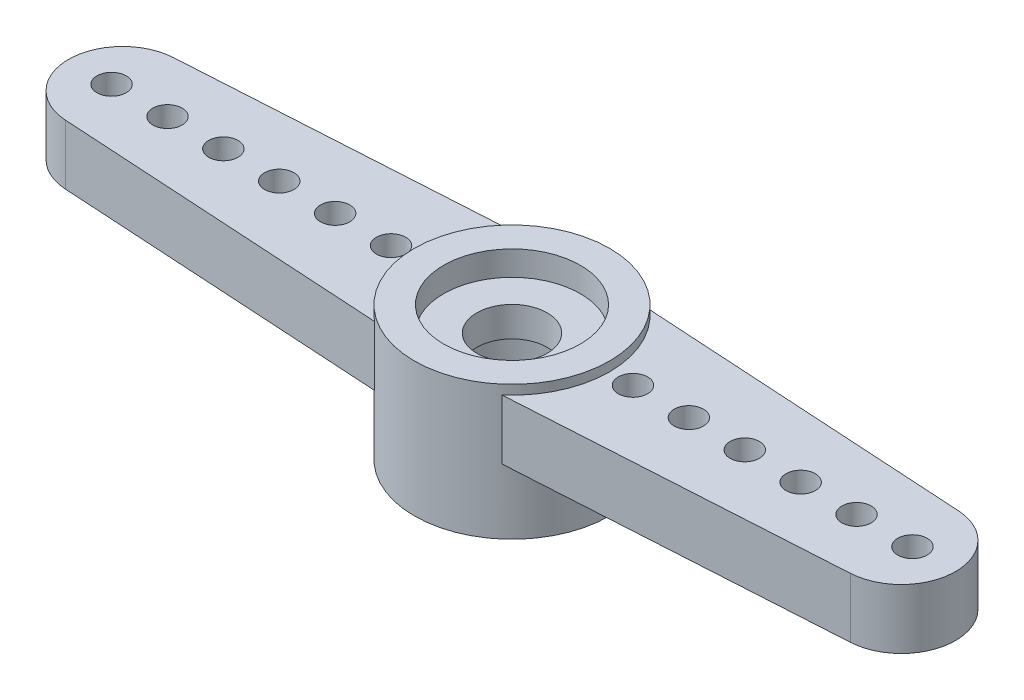
ISO-10303-21;
HEADER;
FILE_DESCRIPTION(('STEP AP214'),'2;1');
FILE_NAME('part.step','',(''),(''),'','','');
FILE_SCHEMA(('AUTOMOTIVE_DESIGN { 1 0 10303 214 1 1 1 1 }'));
ENDSEC;
DATA;
#1=APPLICATION_CONTEXT('core data for automotive mechanical design processes');
#2=APPLICATION_PROTOCOL_DEFINITION('international standard','automotive_design',2000,#1);
#3=PRODUCT_CONTEXT('',#1,'mechanical');
#4=PRODUCT('Part','Part','',(#3));
#5=PRODUCT_RELATED_PRODUCT_CATEGORY('part','',(#4));
#6=PRODUCT_DEFINITION_FORMATION('','',#4);
#7=PRODUCT_DEFINITION_CONTEXT('part definition',#1,'design');
#8=PRODUCT_DEFINITION('design','',#6,#7);
#9=PRODUCT_DEFINITION_SHAPE('','',#8);
#10=(LENGTH_UNIT() NAMED_UNIT(*) SI_UNIT(.MILLI.,.METRE.));
#11=(NAMED_UNIT(*) PLANE_ANGLE_UNIT() SI_UNIT($,.RADIAN.));
#12=(NAMED_UNIT(*) SI_UNIT($,.STERADIAN.) SOLID_ANGLE_UNIT());
#13=UNCERTAINTY_MEASURE_WITH_UNIT(LENGTH_MEASURE(1.E-05),#10,'distance_accuracy_value','');
#14=(GEOMETRIC_REPRESENTATION_CONTEXT(3) GLOBAL_UNCERTAINTY_ASSIGNED_CONTEXT((#13)) GLOBAL_UNIT_ASSIGNED_CONTEXT((#10,
#11,#12)) REPRESENTATION_CONTEXT('',''));
#15=CARTESIAN_POINT('',(0.,0.,0.));
#16=DIRECTION('',(0.,0.,1.));
#17=DIRECTION('',(1.,0.,0.));
#18=AXIS2_PLACEMENT_3D('',#15,#16,#17);
#19=CARTESIAN_POINT('',(0.,4.715,0.));
#20=DIRECTION('',(0.,-1.,0.));
#21=DIRECTION('',(0.,0.,-1.));
#22=AXIS2_PLACEMENT_3D('',#19,#20,#21);
#23=CYLINDRICAL_SURFACE('',#22,1.235);
#24=CARTESIAN_POINT('',(0.,2.8,0.));
#25=DIRECTION('',(0.,-1.,0.));
#26=DIRECTION('',(0.,0.,-1.));
#27=AXIS2_PLACEMENT_3D('',#24,#25,#26);
#28=CIRCLE('',#27,1.235);
#29=CARTESIAN_POINT('',(0.,2.8,-1.235));
#30=VERTEX_POINT('',#29);
#31=EDGE_CURVE('E219',#30,#30,#28,.F.);
#32=ORIENTED_EDGE('',*,*,#31,.F.);
#33=EDGE_LOOP('',(#32));
#34=FACE_BOUND('',#33,.T.);
#35=CARTESIAN_POINT('',(0.,3.85,0.));
#36=DIRECTION('',(0.,-1.,0.));
#37=DIRECTION('',(0.,0.,-1.));
#38=AXIS2_PLACEMENT_3D('',#35,#36,#37);
#39=CIRCLE('',#38,1.235);
#40=CARTESIAN_POINT('',(0.,3.85,-1.235));
#41=VERTEX_POINT('',#40);
#42=EDGE_CURVE('E19',#41,#41,#39,.T.);
#43=ORIENTED_EDGE('',*,*,#42,.F.);
#44=EDGE_LOOP('',(#43));
#45=FACE_BOUND('',#44,.T.);
#46=ADVANCED_FACE('F16',(#34,#45),#23,.F.);
#47=CARTESIAN_POINT('',(0.,3.85,0.));
#48=DIRECTION('',(0.,1.,0.));
#49=DIRECTION('',(0.,0.,1.));
#50=AXIS2_PLACEMENT_3D('',#47,#48,#49);
#51=PLANE('',#50);
#52=CARTESIAN_POINT('',(0.,3.85,0.));
#53=DIRECTION('',(0.,1.,0.));
#54=DIRECTION('',(0.,0.,1.));
#55=AXIS2_PLACEMENT_3D('',#52,#53,#54);
#56=CIRCLE('',#55,2.4);
#57=CARTESIAN_POINT('',(0.,3.85,2.4));
#58=VERTEX_POINT('',#57);
#59=EDGE_CURVE('E217',#58,#58,#56,.T.);
#60=ORIENTED_EDGE('',*,*,#59,.T.);
#61=EDGE_LOOP('',(#60));
#62=FACE_BOUND('',#61,.T.);
#63=ORIENTED_EDGE('',*,*,#42,.T.);
#64=EDGE_LOOP('',(#63));
#65=FACE_BOUND('',#64,.T.);
#66=ADVANCED_FACE('F226',(#62,#65),#51,.T.);
#67=CARTESIAN_POINT('',(14.07,2.285,0.));
#68=DIRECTION('',(0.,1.,0.));
#69=DIRECTION('',(0.,0.,1.));
#70=AXIS2_PLACEMENT_3D('',#67,#68,#69);
#71=CYLINDRICAL_SURFACE('',#70,0.514999999999999);
#72=CARTESIAN_POINT('',(14.07,2.285,0.));
#73=DIRECTION('',(0.,1.,0.));
#74=DIRECTION('',(0.,0.,1.));
#75=AXIS2_PLACEMENT_3D('',#72,#73,#74);
#76=CIRCLE('',#75,0.514999999999999);
#77=CARTESIAN_POINT('',(14.07,2.285,0.515000000000068));
#78=VERTEX_POINT('',#77);
#79=EDGE_CURVE('E214',#78,#78,#76,.F.);
#80=ORIENTED_EDGE('',*,*,#79,.T.);
#81=EDGE_LOOP('',(#80));
#82=FACE_BOUND('',#81,.T.);
#83=CARTESIAN_POINT('',(14.07,4.385,0.));
#84=DIRECTION('',(0.,1.,0.));
#85=DIRECTION('',(0.,0.,1.));
#86=AXIS2_PLACEMENT_3D('',#83,#84,#85);
#87=CIRCLE('',#86,0.514999999999999);
#88=CARTESIAN_POINT('',(14.07,4.385,0.515000000000068));
#89=VERTEX_POINT('',#88);
#90=EDGE_CURVE('E100',#89,#89,#87,.F.);
#91=ORIENTED_EDGE('',*,*,#90,.F.);
#92=EDGE_LOOP('',(#91));
#93=FACE_BOUND('',#92,.T.);
#94=ADVANCED_FACE('F234',(#82,#93),#71,.F.);
#95=CARTESIAN_POINT('',(12.106,2.285,0.));
#96=DIRECTION('',(0.,1.,0.));
#97=DIRECTION('',(0.,0.,1.));
#98=AXIS2_PLACEMENT_3D('',#95,#96,#97);
#99=CYLINDRICAL_SURFACE('',#98,0.515000000000001);
#100=CARTESIAN_POINT('',(12.106,2.285,0.));
#101=DIRECTION('',(0.,1.,0.));
#102=DIRECTION('',(0.,0.,1.));
#103=AXIS2_PLACEMENT_3D('',#100,#101,#102);
#104=CIRCLE('',#103,0.515000000000001);
#105=CARTESIAN_POINT('',(12.106,2.285,0.515000000000056));
#106=VERTEX_POINT('',#105);
#107=EDGE_CURVE('E211',#106,#106,#104,.F.);
#108=ORIENTED_EDGE('',*,*,#107,.T.);
#109=EDGE_LOOP('',(#108));
#110=FACE_BOUND('',#109,.T.);
#111=CARTESIAN_POINT('',(12.106,4.385,0.));
#112=DIRECTION('',(0.,1.,0.));
#113=DIRECTION('',(0.,0.,1.));
#114=AXIS2_PLACEMENT_3D('',#111,#112,#113);
#115=CIRCLE('',#114,0.515000000000001);
#116=CARTESIAN_POINT('',(12.106,4.385,0.515000000000056));
#117=VERTEX_POINT('',#116);
#118=EDGE_CURVE('E198',#117,#117,#115,.F.);
#119=ORIENTED_EDGE('',*,*,#118,.F.);
#120=EDGE_LOOP('',(#119));
#121=FACE_BOUND('',#120,.T.);
#122=ADVANCED_FACE('F337',(#110,#121),#99,.F.);
#123=CARTESIAN_POINT('',(10.142,2.285,0.));
#124=DIRECTION('',(0.,1.,0.));
#125=DIRECTION('',(0.,0.,1.));
#126=AXIS2_PLACEMENT_3D('',#123,#124,#125);
#127=CYLINDRICAL_SURFACE('',#126,0.514999999999999);
#128=CARTESIAN_POINT('',(10.142,2.285,0.));
#129=DIRECTION('',(0.,1.,0.));
#130=DIRECTION('',(0.,0.,1.));
#131=AXIS2_PLACEMENT_3D('',#128,#129,#130);
#132=CIRCLE('',#131,0.514999999999999);
#133=CARTESIAN_POINT('',(10.142,2.285,0.51500000000004));
#134=VERTEX_POINT('',#133);
#135=EDGE_CURVE('E208',#134,#134,#132,.F.);
#136=ORIENTED_EDGE('',*,*,#135,.T.);
#137=EDGE_LOOP('',(#136));
#138=FACE_BOUND('',#137,.T.);
#139=CARTESIAN_POINT('',(10.142,4.385,0.));
#140=DIRECTION('',(0.,1.,0.));
#141=DIRECTION('',(0.,0.,1.));
#142=AXIS2_PLACEMENT_3D('',#139,#140,#141);
#143=CIRCLE('',#142,0.514999999999999);
#144=CARTESIAN_POINT('',(10.142,4.385,0.51500000000004));
#145=VERTEX_POINT('',#144);
#146=EDGE_CURVE('E195',#145,#145,#143,.F.);
#147=ORIENTED_EDGE('',*,*,#146,.F.);
#148=EDGE_LOOP('',(#147));
#149=FACE_BOUND('',#148,.T.);
#150=ADVANCED_FACE('F333',(#138,#149),#127,.F.);
#151=CARTESIAN_POINT('',(8.178,2.285,0.));
#152=DIRECTION('',(0.,1.,0.));
#153=DIRECTION('',(0.,0.,1.));
#154=AXIS2_PLACEMENT_3D('',#151,#152,#153);
#155=CYLINDRICAL_SURFACE('',#154,0.515);
#156=CARTESIAN_POINT('',(8.178,2.285,0.));
#157=DIRECTION('',(0.,1.,0.));
#158=DIRECTION('',(0.,0.,1.));
#159=AXIS2_PLACEMENT_3D('',#156,#157,#158);
#160=CIRCLE('',#159,0.515);
#161=CARTESIAN_POINT('',(8.178,2.285,0.515000000000027));
#162=VERTEX_POINT('',#161);
#163=EDGE_CURVE('E205',#162,#162,#160,.F.);
#164=ORIENTED_EDGE('',*,*,#163,.T.);
#165=EDGE_LOOP('',(#164));
#166=FACE_BOUND('',#165,.T.);
#167=CARTESIAN_POINT('',(8.178,4.385,0.));
#168=DIRECTION('',(0.,1.,0.));
#169=DIRECTION('',(0.,0.,1.));
#170=AXIS2_PLACEMENT_3D('',#167,#168,#169);
#171=CIRCLE('',#170,0.515);
#172=CARTESIAN_POINT('',(8.178,4.385,0.515000000000027));
#173=VERTEX_POINT('',#172);
#174=EDGE_CURVE('E192',#173,#173,#171,.F.);
#175=ORIENTED_EDGE('',*,*,#174,.F.);
#176=EDGE_LOOP('',(#175));
#177=FACE_BOUND('',#176,.T.);
#178=ADVANCED_FACE('F329',(#166,#177),#155,.F.);
#179=CARTESIAN_POINT('',(6.214,2.285,0.));
#180=DIRECTION('',(0.,1.,0.));
#181=DIRECTION('',(0.,0.,1.));
#182=AXIS2_PLACEMENT_3D('',#179,#180,#181);
#183=CYLINDRICAL_SURFACE('',#182,0.515);
#184=CARTESIAN_POINT('',(6.214,2.285,0.));
#185=DIRECTION('',(0.,1.,0.));
#186=DIRECTION('',(0.,0.,1.));
#187=AXIS2_PLACEMENT_3D('',#184,#185,#186);
#188=CIRCLE('',#187,0.515);
#189=CARTESIAN_POINT('',(6.214,2.285,0.515000000000014));
#190=VERTEX_POINT('',#189);
#191=EDGE_CURVE('E91',#190,#190,#188,.F.);
#192=ORIENTED_EDGE('',*,*,#191,.T.);
#193=EDGE_LOOP('',(#192));
#194=FACE_BOUND('',#193,.T.);
#195=CARTESIAN_POINT('',(6.214,4.385,0.));
#196=DIRECTION('',(0.,1.,0.));
#197=DIRECTION('',(0.,0.,1.));
#198=AXIS2_PLACEMENT_3D('',#195,#196,#197);
#199=CIRCLE('',#198,0.515);
#200=CARTESIAN_POINT('',(6.214,4.385,0.515000000000014));
#201=VERTEX_POINT('',#200);
#202=EDGE_CURVE('E189',#201,#201,#199,.F.);
#203=ORIENTED_EDGE('',*,*,#202,.F.);
#204=EDGE_LOOP('',(#203));
#205=FACE_BOUND('',#204,.T.);
#206=ADVANCED_FACE('F325',(#194,#205),#183,.F.);
#207=CARTESIAN_POINT('',(4.25,2.285,0.));
#208=DIRECTION('',(0.,1.,0.));
#209=DIRECTION('',(0.,0.,1.));
#210=AXIS2_PLACEMENT_3D('',#207,#208,#209);
#211=CYLINDRICAL_SURFACE('',#210,0.515);
#212=CARTESIAN_POINT('',(4.25,2.285,0.));
#213=DIRECTION('',(0.,1.,0.));
#214=DIRECTION('',(0.,0.,1.));
#215=AXIS2_PLACEMENT_3D('',#212,#213,#214);
#216=CIRCLE('',#215,0.515);
#217=CARTESIAN_POINT('',(4.25,2.285,0.515000000000001));
#218=VERTEX_POINT('',#217);
#219=EDGE_CURVE('E90',#218,#218,#216,.F.);
#220=ORIENTED_EDGE('',*,*,#219,.T.);
#221=EDGE_LOOP('',(#220));
#222=FACE_BOUND('',#221,.T.);
#223=CARTESIAN_POINT('',(4.25,4.385,0.));
#224=DIRECTION('',(0.,1.,0.));
#225=DIRECTION('',(0.,0.,1.));
#226=AXIS2_PLACEMENT_3D('',#223,#224,#225);
#227=CIRCLE('',#226,0.515);
#228=CARTESIAN_POINT('',(4.25,4.385,0.515000000000001));
#229=VERTEX_POINT('',#228);
#230=EDGE_CURVE('E115',#229,#229,#227,.F.);
#231=ORIENTED_EDGE('',*,*,#230,.F.);
#232=EDGE_LOOP('',(#231));
#233=FACE_BOUND('',#232,.T.);
#234=ADVANCED_FACE('F322',(#222,#233),#211,.F.);
#235=CARTESIAN_POINT('',(13.6815650653264,2.285,0.));
#236=DIRECTION('',(0.,1.,0.));
#237=DIRECTION('',(0.,0.,1.));
#238=AXIS2_PLACEMENT_3D('',#235,#236,#237);
#239=CYLINDRICAL_SURFACE('',#238,1.90343493467358);
#240=CARTESIAN_POINT('',(13.6815650653264,2.285,0.));
#241=DIRECTION('',(0.,1.,0.));
#242=DIRECTION('',(0.,0.,1.));
#243=AXIS2_PLACEMENT_3D('',#240,#241,#242);
#244=CIRCLE('',#243,1.90343493467358);
#245=CARTESIAN_POINT('',(13.7958653301373,2.285,1.9));
#246=VERTEX_POINT('',#245);
#247=CARTESIAN_POINT('',(13.7958653301373,2.285,-1.9));
#248=VERTEX_POINT('',#247);
#249=EDGE_CURVE('E79',#246,#248,#244,.T.);
#250=ORIENTED_EDGE('',*,*,#249,.T.);
#251=DIRECTION('',(0.,1.,0.));
#252=VECTOR('',#251,1.);
#253=CARTESIAN_POINT('',(13.7958653301373,2.285,-1.9));
#254=LINE('',#253,#252);
#255=CARTESIAN_POINT('',(13.7958653301373,4.385,-1.9));
#256=VERTEX_POINT('',#255);
#257=EDGE_CURVE('E114',#248,#256,#254,.T.);
#258=ORIENTED_EDGE('',*,*,#257,.T.);
#259=CARTESIAN_POINT('',(13.6815650653264,4.385,0.));
#260=DIRECTION('',(0.,1.,0.));
#261=DIRECTION('',(0.,0.,1.));
#262=AXIS2_PLACEMENT_3D('',#259,#260,#261);
#263=CIRCLE('',#262,1.90343493467358);
#264=CARTESIAN_POINT('',(13.7958653301373,4.385,1.9));
#265=VERTEX_POINT('',#264);
#266=EDGE_CURVE('E97',#265,#256,#263,.T.);
#267=ORIENTED_EDGE('',*,*,#266,.F.);
#268=DIRECTION('',(0.,1.,0.));
#269=VECTOR('',#268,1.);
#270=CARTESIAN_POINT('',(13.7958653301373,2.285,1.9));
#271=LINE('',#270,#269);
#272=EDGE_CURVE('E94',#246,#265,#271,.T.);
#273=ORIENTED_EDGE('',*,*,#272,.F.);
#274=EDGE_LOOP('',(#250,#258,#267,#273));
#275=FACE_BOUND('',#274,.T.);
#276=ADVANCED_FACE('F95',(#275),#239,.T.);
#277=CARTESIAN_POINT('',(0.,2.8,0.));
#278=DIRECTION('',(0.,-1.,0.));
#279=DIRECTION('',(0.,0.,-1.));
#280=AXIS2_PLACEMENT_3D('',#277,#278,#279);
#281=PLANE('',#280);
#282=CARTESIAN_POINT('',(0.,2.8,0.));
#283=DIRECTION('',(0.,-1.,0.));
#284=DIRECTION('',(0.,0.,-1.));
#285=AXIS2_PLACEMENT_3D('',#282,#283,#284);
#286=CIRCLE('',#285,2.345);
#287=CARTESIAN_POINT('',(0.,2.8,-2.345));
#288=VERTEX_POINT('',#287);
#289=EDGE_CURVE('E182',#288,#288,#286,.T.);
#290=ORIENTED_EDGE('',*,*,#289,.T.);
#291=EDGE_LOOP('',(#290));
#292=FACE_BOUND('',#291,.T.);
#293=ORIENTED_EDGE('',*,*,#31,.T.);
#294=EDGE_LOOP('',(#293));
#295=FACE_BOUND('',#294,.T.);
#296=ADVANCED_FACE('F315',(#292,#295),#281,.T.);
#297=CARTESIAN_POINT('',(0.,3.85,0.));
#298=DIRECTION('',(0.,1.,0.));
#299=DIRECTION('',(0.,0.,1.));
#300=AXIS2_PLACEMENT_3D('',#297,#298,#299);
#301=CYLINDRICAL_SURFACE('',#300,2.4);
#302=CARTESIAN_POINT('',(0.,4.715,0.));
#303=DIRECTION('',(0.,1.,0.));
#304=DIRECTION('',(0.,0.,1.));
#305=AXIS2_PLACEMENT_3D('',#302,#303,#304);
#306=CIRCLE('',#305,2.4);
#307=CARTESIAN_POINT('',(0.,4.715,2.4));
#308=VERTEX_POINT('',#307);
#309=EDGE_CURVE('E179',#308,#308,#306,.F.);
#310=ORIENTED_EDGE('',*,*,#309,.F.);
#311=EDGE_LOOP('',(#310));
#312=FACE_BOUND('',#311,.T.);
#313=ORIENTED_EDGE('',*,*,#59,.F.);
#314=EDGE_LOOP('',(#313));
#315=FACE_BOUND('',#314,.T.);
#316=ADVANCED_FACE('F311',(#312,#315),#301,.F.);
#317=CARTESIAN_POINT('',(0.,2.285,0.));
#318=DIRECTION('',(0.,1.,0.));
#319=DIRECTION('',(0.,0.,1.));
#320=AXIS2_PLACEMENT_3D('',#317,#318,#319);
#321=PLANE('',#320);
#322=ORIENTED_EDGE('',*,*,#219,.F.);
#323=EDGE_LOOP('',(#322));
#324=FACE_BOUND('',#323,.T.);
#325=DIRECTION('',(0.99819540210647,0.,0.0600494730493309));
#326=VECTOR('',#325,1.);
#327=CARTESIAN_POINT('',(0.16363515678198,2.285,-2.72008816777725));
#328=LINE('',#327,#326);
#329=CARTESIAN_POINT('',(2.24296121232624,2.285,-2.595));
#330=VERTEX_POINT('',#329);
#331=EDGE_CURVE('E87',#330,#248,#328,.T.);
#332=ORIENTED_EDGE('',*,*,#331,.T.);
#333=ORIENTED_EDGE('',*,*,#249,.F.);
#334=DIRECTION('',(0.99819540210647,0.,-0.060049473049331));
#335=VECTOR('',#334,1.);
#336=CARTESIAN_POINT('',(0.16363515678198,2.285,2.72008816777725));
#337=LINE('',#336,#335);
#338=CARTESIAN_POINT('',(2.24296121232624,2.285,2.595));
#339=VERTEX_POINT('',#338);
#340=EDGE_CURVE('E84',#339,#246,#337,.T.);
#341=ORIENTED_EDGE('',*,*,#340,.F.);
#342=CARTESIAN_POINT('',(0.,2.285,0.));
#343=DIRECTION('',(0.,-1.,0.));
#344=DIRECTION('',(0.,0.,-1.));
#345=AXIS2_PLACEMENT_3D('',#342,#343,#344);
#346=CIRCLE('',#345,3.43);
#347=EDGE_CURVE('E177',#330,#339,#346,.T.);
#348=ORIENTED_EDGE('',*,*,#347,.F.);
#349=EDGE_LOOP('',(#332,#333,#341,#348));
#350=FACE_BOUND('',#349,.T.);
#351=ORIENTED_EDGE('',*,*,#191,.F.);
#352=EDGE_LOOP('',(#351));
#353=FACE_BOUND('',#352,.T.);
#354=ORIENTED_EDGE('',*,*,#163,.F.);
#355=EDGE_LOOP('',(#354));
#356=FACE_BOUND('',#355,.T.);
#357=ORIENTED_EDGE('',*,*,#135,.F.);
#358=EDGE_LOOP('',(#357));
#359=FACE_BOUND('',#358,.T.);
#360=ORIENTED_EDGE('',*,*,#107,.F.);
#361=EDGE_LOOP('',(#360));
#362=FACE_BOUND('',#361,.T.);
#363=ORIENTED_EDGE('',*,*,#79,.F.);
#364=EDGE_LOOP('',(#363));
#365=FACE_BOUND('',#364,.T.);
#366=ADVANCED_FACE('F81',(#324,#350,#353,#356,#359,#362,#365),#321,.F.);
#367=CARTESIAN_POINT('',(0.16363515678198,2.285,2.72008816777725));
#368=DIRECTION('',(0.060049473049331,0.,0.99819540210647));
#369=DIRECTION('',(0.99819540210647,0.,-0.060049473049331));
#370=AXIS2_PLACEMENT_3D('',#367,#368,#369);
#371=PLANE('',#370);
#372=ORIENTED_EDGE('',*,*,#340,.T.);
#373=ORIENTED_EDGE('',*,*,#272,.T.);
#374=DIRECTION('',(0.99819540210647,0.,-0.0600494730493309));
#375=VECTOR('',#374,1.);
#376=CARTESIAN_POINT('',(2.24296121232624,4.385,2.595));
#377=LINE('',#376,#375);
#378=CARTESIAN_POINT('',(2.24296121232624,4.385,2.595));
#379=VERTEX_POINT('',#378);
#380=EDGE_CURVE('E188',#379,#265,#377,.T.);
#381=ORIENTED_EDGE('',*,*,#380,.F.);
#382=DIRECTION('',(0.,-1.,0.));
#383=VECTOR('',#382,1.);
#384=CARTESIAN_POINT('',(2.24296121232624,4.715,2.595));
#385=LINE('',#384,#383);
#386=EDGE_CURVE('E104',#339,#379,#385,.F.);
#387=ORIENTED_EDGE('',*,*,#386,.F.);
#388=EDGE_LOOP('',(#372,#373,#381,#387));
#389=FACE_BOUND('',#388,.T.);
#390=ADVANCED_FACE('F102',(#389),#371,.T.);
#391=CARTESIAN_POINT('',(0.,4.385,0.));
#392=DIRECTION('',(0.,1.,0.));
#393=DIRECTION('',(0.,0.,1.));
#394=AXIS2_PLACEMENT_3D('',#391,#392,#393);
#395=PLANE('',#394);
#396=ORIENTED_EDGE('',*,*,#230,.T.);
#397=EDGE_LOOP('',(#396));
#398=FACE_BOUND('',#397,.T.);
#399=ORIENTED_EDGE('',*,*,#266,.T.);
#400=DIRECTION('',(0.99819540210647,0.,0.0600494730493309));
#401=VECTOR('',#400,1.);
#402=CARTESIAN_POINT('',(0.16363515678198,4.385,-2.72008816777725));
#403=LINE('',#402,#401);
#404=CARTESIAN_POINT('',(2.24296121232624,4.385,-2.595));
#405=VERTEX_POINT('',#404);
#406=EDGE_CURVE('E111',#256,#405,#403,.F.);
#407=ORIENTED_EDGE('',*,*,#406,.T.);
#408=CARTESIAN_POINT('',(0.,4.385,0.));
#409=DIRECTION('',(0.,-1.,0.));
#410=DIRECTION('',(0.,0.,-1.));
#411=AXIS2_PLACEMENT_3D('',#408,#409,#410);
#412=CIRCLE('',#411,3.43);
#413=EDGE_CURVE('E174',#379,#405,#412,.F.);
#414=ORIENTED_EDGE('',*,*,#413,.F.);
#415=ORIENTED_EDGE('',*,*,#380,.T.);
#416=EDGE_LOOP('',(#399,#407,#414,#415));
#417=FACE_BOUND('',#416,.T.);
#418=ORIENTED_EDGE('',*,*,#202,.T.);
#419=EDGE_LOOP('',(#418));
#420=FACE_BOUND('',#419,.T.);
#421=ORIENTED_EDGE('',*,*,#174,.T.);
#422=EDGE_LOOP('',(#421));
#423=FACE_BOUND('',#422,.T.);
#424=ORIENTED_EDGE('',*,*,#146,.T.);
#425=EDGE_LOOP('',(#424));
#426=FACE_BOUND('',#425,.T.);
#427=ORIENTED_EDGE('',*,*,#118,.T.);
#428=EDGE_LOOP('',(#427));
#429=FACE_BOUND('',#428,.T.);
#430=ORIENTED_EDGE('',*,*,#90,.T.);
#431=EDGE_LOOP('',(#430));
#432=FACE_BOUND('',#431,.T.);
#433=ADVANCED_FACE('F302',(#398,#417,#420,#423,#426,#429,#432),#395,.T.);
#434=CARTESIAN_POINT('',(0.16363515678198,2.285,-2.72008816777725));
#435=DIRECTION('',(-0.0600494730493309,0.,0.99819540210647));
#436=DIRECTION('',(0.99819540210647,0.,0.0600494730493309));
#437=AXIS2_PLACEMENT_3D('',#434,#435,#436);
#438=PLANE('',#437);
#439=ORIENTED_EDGE('',*,*,#257,.F.);
#440=ORIENTED_EDGE('',*,*,#331,.F.);
#441=DIRECTION('',(0.,-1.,0.));
#442=VECTOR('',#441,1.);
#443=CARTESIAN_POINT('',(2.24296121232624,4.715,-2.595));
#444=LINE('',#443,#442);
#445=EDGE_CURVE('E173',#405,#330,#444,.T.);
#446=ORIENTED_EDGE('',*,*,#445,.F.);
#447=ORIENTED_EDGE('',*,*,#406,.F.);
#448=EDGE_LOOP('',(#439,#440,#446,#447));
#449=FACE_BOUND('',#448,.T.);
#450=ADVANCED_FACE('F298',(#449),#438,.F.);
#451=CARTESIAN_POINT('',(0.,2.8,0.));
#452=DIRECTION('',(0.,-1.,0.));
#453=DIRECTION('',(0.,0.,-1.));
#454=AXIS2_PLACEMENT_3D('',#451,#452,#453);
#455=CYLINDRICAL_SURFACE('',#454,2.345);
#456=ORIENTED_EDGE('',*,*,#289,.F.);
#457=EDGE_LOOP('',(#456));
#458=FACE_BOUND('',#457,.T.);
#459=CARTESIAN_POINT('',(0.,0.,0.));
#460=DIRECTION('',(0.,-1.,0.));
#461=DIRECTION('',(0.,0.,-1.));
#462=AXIS2_PLACEMENT_3D('',#459,#460,#461);
#463=CIRCLE('',#462,2.345);
#464=CARTESIAN_POINT('',(0.,0.,-2.345));
#465=VERTEX_POINT('',#464);
#466=EDGE_CURVE('E170',#465,#465,#463,.T.);
#467=ORIENTED_EDGE('',*,*,#466,.T.);
#468=EDGE_LOOP('',(#467));
#469=FACE_BOUND('',#468,.T.);
#470=ADVANCED_FACE('F294',(#458,#469),#455,.F.);
#471=CARTESIAN_POINT('',(0.,4.715,0.));
#472=DIRECTION('',(0.,1.,0.));
#473=DIRECTION('',(0.,0.,1.));
#474=AXIS2_PLACEMENT_3D('',#471,#472,#473);
#475=PLANE('',#474);
#476=CARTESIAN_POINT('',(0.,4.715,0.));
#477=DIRECTION('',(0.,-1.,0.));
#478=DIRECTION('',(0.,0.,-1.));
#479=AXIS2_PLACEMENT_3D('',#476,#477,#478);
#480=CIRCLE('',#479,3.43);
#481=CARTESIAN_POINT('',(0.,4.715,-3.43));
#482=VERTEX_POINT('',#481);
#483=EDGE_CURVE('E152',#482,#482,#480,.T.);
#484=ORIENTED_EDGE('',*,*,#483,.F.);
#485=EDGE_LOOP('',(#484));
#486=FACE_BOUND('',#485,.T.);
#487=ORIENTED_EDGE('',*,*,#309,.T.);
#488=EDGE_LOOP('',(#487));
#489=FACE_BOUND('',#488,.T.);
#490=ADVANCED_FACE('F290',(#486,#489),#475,.T.);
#491=CARTESIAN_POINT('',(0.,0.,0.));
#492=DIRECTION('',(0.,1.,0.));
#493=DIRECTION('',(0.,0.,1.));
#494=AXIS2_PLACEMENT_3D('',#491,#492,#493);
#495=PLANE('',#494);
#496=CARTESIAN_POINT('',(0.,0.,0.));
#497=DIRECTION('',(0.,-1.,0.));
#498=DIRECTION('',(0.,0.,-1.));
#499=AXIS2_PLACEMENT_3D('',#496,#497,#498);
#500=CIRCLE('',#499,3.43);
#501=CARTESIAN_POINT('',(0.,0.,-3.43));
#502=VERTEX_POINT('',#501);
#503=EDGE_CURVE('E149',#502,#502,#500,.F.);
#504=ORIENTED_EDGE('',*,*,#503,.F.);
#505=EDGE_LOOP('',(#504));
#506=FACE_BOUND('',#505,.T.);
#507=ORIENTED_EDGE('',*,*,#466,.F.);
#508=EDGE_LOOP('',(#507));
#509=FACE_BOUND('',#508,.T.);
#510=ADVANCED_FACE('F286',(#506,#509),#495,.F.);
#511=CARTESIAN_POINT('',(0.,2.285,0.));
#512=DIRECTION('',(0.,1.,0.));
#513=DIRECTION('',(0.,0.,1.));
#514=AXIS2_PLACEMENT_3D('',#511,#512,#513);
#515=PLANE('',#514);
#516=CARTESIAN_POINT('',(-4.25,2.285,0.));
#517=DIRECTION('',(0.,1.,0.));
#518=DIRECTION('',(0.,0.,1.));
#519=AXIS2_PLACEMENT_3D('',#516,#517,#518);
#520=CIRCLE('',#519,0.515);
#521=CARTESIAN_POINT('',(-4.25,2.285,0.515000000000001));
#522=VERTEX_POINT('',#521);
#523=EDGE_CURVE('E139',#522,#522,#520,.T.);
#524=ORIENTED_EDGE('',*,*,#523,.T.);
#525=EDGE_LOOP('',(#524));
#526=FACE_BOUND('',#525,.T.);
#527=DIRECTION('',(-0.99819540210647,0.,-0.060049473049331));
#528=VECTOR('',#527,1.);
#529=CARTESIAN_POINT('',(-0.16363515678198,2.285,2.72008816777725));
#530=LINE('',#529,#528);
#531=CARTESIAN_POINT('',(-2.24296121232624,2.285,2.595));
#532=VERTEX_POINT('',#531);
#533=CARTESIAN_POINT('',(-13.7958653301373,2.285,1.9));
#534=VERTEX_POINT('',#533);
#535=EDGE_CURVE('E595',#532,#534,#530,.T.);
#536=ORIENTED_EDGE('',*,*,#535,.T.);
#537=CARTESIAN_POINT('',(-13.6815650653264,2.285,0.));
#538=DIRECTION('',(0.,1.,0.));
#539=DIRECTION('',(0.,0.,1.));
#540=AXIS2_PLACEMENT_3D('',#537,#538,#539);
#541=CIRCLE('',#540,1.90343493467358);
#542=CARTESIAN_POINT('',(-13.7958653301373,2.285,-1.9));
#543=VERTEX_POINT('',#542);
#544=EDGE_CURVE('E142',#543,#534,#541,.T.);
#545=ORIENTED_EDGE('',*,*,#544,.F.);
#546=DIRECTION('',(-0.99819540210647,0.,0.0600494730493309));
#547=VECTOR('',#546,1.);
#548=CARTESIAN_POINT('',(-0.16363515678198,2.285,-2.72008816777725));
#549=LINE('',#548,#547);
#550=CARTESIAN_POINT('',(-2.24296121232624,2.285,-2.595));
#551=VERTEX_POINT('',#550);
#552=EDGE_CURVE('E593',#551,#543,#549,.T.);
#553=ORIENTED_EDGE('',*,*,#552,.F.);
#554=CARTESIAN_POINT('',(0.,2.285,0.));
#555=DIRECTION('',(0.,-1.,0.));
#556=DIRECTION('',(0.,0.,-1.));
#557=AXIS2_PLACEMENT_3D('',#554,#555,#556);
#558=CIRCLE('',#557,3.43);
#559=EDGE_CURVE('E146',#532,#551,#558,.T.);
#560=ORIENTED_EDGE('',*,*,#559,.F.);
#561=EDGE_LOOP('',(#536,#545,#553,#560));
#562=FACE_BOUND('',#561,.T.);
#563=CARTESIAN_POINT('',(-6.214,2.285,0.));
#564=DIRECTION('',(0.,1.,0.));
#565=DIRECTION('',(0.,0.,1.));
#566=AXIS2_PLACEMENT_3D('',#563,#564,#565);
#567=CIRCLE('',#566,0.515);
#568=CARTESIAN_POINT('',(-6.214,2.285,0.515000000000014));
#569=VERTEX_POINT('',#568);
#570=EDGE_CURVE('E155',#569,#569,#567,.T.);
#571=ORIENTED_EDGE('',*,*,#570,.T.);
#572=EDGE_LOOP('',(#571));
#573=FACE_BOUND('',#572,.T.);
#574=CARTESIAN_POINT('',(-8.178,2.285,0.));
#575=DIRECTION('',(0.,1.,0.));
#576=DIRECTION('',(0.,0.,1.));
#577=AXIS2_PLACEMENT_3D('',#574,#575,#576);
#578=CIRCLE('',#577,0.515);
#579=CARTESIAN_POINT('',(-8.178,2.285,0.515000000000027));
#580=VERTEX_POINT('',#579);
#581=EDGE_CURVE('E158',#580,#580,#578,.T.);
#582=ORIENTED_EDGE('',*,*,#581,.T.);
#583=EDGE_LOOP('',(#582));
#584=FACE_BOUND('',#583,.T.);
#585=CARTESIAN_POINT('',(-10.142,2.285,0.));
#586=DIRECTION('',(0.,1.,0.));
#587=DIRECTION('',(0.,0.,1.));
#588=AXIS2_PLACEMENT_3D('',#585,#586,#587);
#589=CIRCLE('',#588,0.514999999999999);
#590=CARTESIAN_POINT('',(-10.142,2.285,0.51500000000004));
#591=VERTEX_POINT('',#590);
#592=EDGE_CURVE('E161',#591,#591,#589,.T.);
#593=ORIENTED_EDGE('',*,*,#592,.T.);
#594=EDGE_LOOP('',(#593));
#595=FACE_BOUND('',#594,.T.);
#596=CARTESIAN_POINT('',(-12.106,2.285,0.));
#597=DIRECTION('',(0.,1.,0.));
#598=DIRECTION('',(0.,0.,1.));
#599=AXIS2_PLACEMENT_3D('',#596,#597,#598);
#600=CIRCLE('',#599,0.515000000000001);
#601=CARTESIAN_POINT('',(-12.106,2.285,0.515000000000056));
#602=VERTEX_POINT('',#601);
#603=EDGE_CURVE('E164',#602,#602,#600,.T.);
#604=ORIENTED_EDGE('',*,*,#603,.T.);
#605=EDGE_LOOP('',(#604));
#606=FACE_BOUND('',#605,.T.);
#607=CARTESIAN_POINT('',(-14.07,2.285,0.));
#608=DIRECTION('',(0.,1.,0.));
#609=DIRECTION('',(0.,0.,1.));
#610=AXIS2_PLACEMENT_3D('',#607,#608,#609);
#611=CIRCLE('',#610,0.514999999999999);
#612=CARTESIAN_POINT('',(-14.07,2.285,0.515000000000068));
#613=VERTEX_POINT('',#612);
#614=EDGE_CURVE('E167',#613,#613,#611,.T.);
#615=ORIENTED_EDGE('',*,*,#614,.T.);
#616=EDGE_LOOP('',(#615));
#617=FACE_BOUND('',#616,.T.);
#618=ADVANCED_FACE('F282',(#526,#562,#573,#584,#595,#606,#617),#515,.F.);
#619=CARTESIAN_POINT('',(-14.07,2.285,0.));
#620=DIRECTION('',(0.,1.,0.));
#621=DIRECTION('',(0.,0.,1.));
#622=AXIS2_PLACEMENT_3D('',#619,#620,#621);
#623=CYLINDRICAL_SURFACE('',#622,0.514999999999999);
#624=CARTESIAN_POINT('',(-14.07,4.385,0.));
#625=DIRECTION('',(0.,1.,0.));
#626=DIRECTION('',(0.,0.,1.));
#627=AXIS2_PLACEMENT_3D('',#624,#625,#626);
#628=CIRCLE('',#627,0.514999999999999);
#629=CARTESIAN_POINT('',(-14.07,4.385,0.515000000000068));
#630=VERTEX_POINT('',#629);
#631=EDGE_CURVE('E136',#630,#630,#628,.F.);
#632=ORIENTED_EDGE('',*,*,#631,.F.);
#633=EDGE_LOOP('',(#632));
#634=FACE_BOUND('',#633,.T.);
#635=ORIENTED_EDGE('',*,*,#614,.F.);
#636=EDGE_LOOP('',(#635));
#637=FACE_BOUND('',#636,.T.);
#638=ADVANCED_FACE('F278',(#634,#637),#623,.F.);
#639=CARTESIAN_POINT('',(-12.106,2.285,0.));
#640=DIRECTION('',(0.,1.,0.));
#641=DIRECTION('',(0.,0.,1.));
#642=AXIS2_PLACEMENT_3D('',#639,#640,#641);
#643=CYLINDRICAL_SURFACE('',#642,0.515000000000001);
#644=CARTESIAN_POINT('',(-12.106,4.385,0.));
#645=DIRECTION('',(0.,1.,0.));
#646=DIRECTION('',(0.,0.,1.));
#647=AXIS2_PLACEMENT_3D('',#644,#645,#646);
#648=CIRCLE('',#647,0.515000000000001);
#649=CARTESIAN_POINT('',(-12.106,4.385,0.515000000000056));
#650=VERTEX_POINT('',#649);
#651=EDGE_CURVE('E133',#650,#650,#648,.F.);
#652=ORIENTED_EDGE('',*,*,#651,.F.);
#653=EDGE_LOOP('',(#652));
#654=FACE_BOUND('',#653,.T.);
#655=ORIENTED_EDGE('',*,*,#603,.F.);
#656=EDGE_LOOP('',(#655));
#657=FACE_BOUND('',#656,.T.);
#658=ADVANCED_FACE('F274',(#654,#657),#643,.F.);
#659=CARTESIAN_POINT('',(-10.142,2.285,0.));
#660=DIRECTION('',(0.,1.,0.));
#661=DIRECTION('',(0.,0.,1.));
#662=AXIS2_PLACEMENT_3D('',#659,#660,#661);
#663=CYLINDRICAL_SURFACE('',#662,0.514999999999999);
#664=CARTESIAN_POINT('',(-10.142,4.385,0.));
#665=DIRECTION('',(0.,1.,0.));
#666=DIRECTION('',(0.,0.,1.));
#667=AXIS2_PLACEMENT_3D('',#664,#665,#666);
#668=CIRCLE('',#667,0.514999999999999);
#669=CARTESIAN_POINT('',(-10.142,4.385,0.51500000000004));
#670=VERTEX_POINT('',#669);
#671=EDGE_CURVE('E130',#670,#670,#668,.F.);
#672=ORIENTED_EDGE('',*,*,#671,.F.);
#673=EDGE_LOOP('',(#672));
#674=FACE_BOUND('',#673,.T.);
#675=ORIENTED_EDGE('',*,*,#592,.F.);
#676=EDGE_LOOP('',(#675));
#677=FACE_BOUND('',#676,.T.);
#678=ADVANCED_FACE('F270',(#674,#677),#663,.F.);
#679=CARTESIAN_POINT('',(-8.178,2.285,0.));
#680=DIRECTION('',(0.,1.,0.));
#681=DIRECTION('',(0.,0.,1.));
#682=AXIS2_PLACEMENT_3D('',#679,#680,#681);
#683=CYLINDRICAL_SURFACE('',#682,0.515);
#684=CARTESIAN_POINT('',(-8.178,4.385,0.));
#685=DIRECTION('',(0.,1.,0.));
#686=DIRECTION('',(0.,0.,1.));
#687=AXIS2_PLACEMENT_3D('',#684,#685,#686);
#688=CIRCLE('',#687,0.515);
#689=CARTESIAN_POINT('',(-8.178,4.385,0.515000000000027));
#690=VERTEX_POINT('',#689);
#691=EDGE_CURVE('E127',#690,#690,#688,.F.);
#692=ORIENTED_EDGE('',*,*,#691,.F.);
#693=EDGE_LOOP('',(#692));
#694=FACE_BOUND('',#693,.T.);
#695=ORIENTED_EDGE('',*,*,#581,.F.);
#696=EDGE_LOOP('',(#695));
#697=FACE_BOUND('',#696,.T.);
#698=ADVANCED_FACE('F266',(#694,#697),#683,.F.);
#699=CARTESIAN_POINT('',(-6.214,2.285,0.));
#700=DIRECTION('',(0.,1.,0.));
#701=DIRECTION('',(0.,0.,1.));
#702=AXIS2_PLACEMENT_3D('',#699,#700,#701);
#703=CYLINDRICAL_SURFACE('',#702,0.515);
#704=CARTESIAN_POINT('',(-6.214,4.385,0.));
#705=DIRECTION('',(0.,1.,0.));
#706=DIRECTION('',(0.,0.,1.));
#707=AXIS2_PLACEMENT_3D('',#704,#705,#706);
#708=CIRCLE('',#707,0.515);
#709=CARTESIAN_POINT('',(-6.214,4.385,0.515000000000014));
#710=VERTEX_POINT('',#709);
#711=EDGE_CURVE('E124',#710,#710,#708,.F.);
#712=ORIENTED_EDGE('',*,*,#711,.F.);
#713=EDGE_LOOP('',(#712));
#714=FACE_BOUND('',#713,.T.);
#715=ORIENTED_EDGE('',*,*,#570,.F.);
#716=EDGE_LOOP('',(#715));
#717=FACE_BOUND('',#716,.T.);
#718=ADVANCED_FACE('F262',(#714,#717),#703,.F.);
#719=CARTESIAN_POINT('',(0.,4.715,0.));
#720=DIRECTION('',(0.,-1.,0.));
#721=DIRECTION('',(0.,0.,-1.));
#722=AXIS2_PLACEMENT_3D('',#719,#720,#721);
#723=CYLINDRICAL_SURFACE('',#722,3.43);
#724=ORIENTED_EDGE('',*,*,#483,.T.);
#725=EDGE_LOOP('',(#724));
#726=FACE_BOUND('',#725,.T.);
#727=CARTESIAN_POINT('',(0.,4.385,0.));
#728=DIRECTION('',(0.,-1.,0.));
#729=DIRECTION('',(0.,0.,-1.));
#730=AXIS2_PLACEMENT_3D('',#727,#728,#729);
#731=CIRCLE('',#730,3.43);
#732=CARTESIAN_POINT('',(-2.24296121232624,4.385,2.595));
#733=VERTEX_POINT('',#732);
#734=CARTESIAN_POINT('',(-2.24296121232624,4.385,-2.595));
#735=VERTEX_POINT('',#734);
#736=EDGE_CURVE('E121',#733,#735,#731,.T.);
#737=ORIENTED_EDGE('',*,*,#736,.F.);
#738=DIRECTION('',(0.,1.,0.));
#739=VECTOR('',#738,1.);
#740=CARTESIAN_POINT('',(-2.24296121232624,2.285,2.595));
#741=LINE('',#740,#739);
#742=EDGE_CURVE('E144',#733,#532,#741,.F.);
#743=ORIENTED_EDGE('',*,*,#742,.T.);
#744=ORIENTED_EDGE('',*,*,#559,.T.);
#745=DIRECTION('',(0.,1.,0.));
#746=VECTOR('',#745,1.);
#747=CARTESIAN_POINT('',(-2.24296121232624,2.285,-2.595));
#748=LINE('',#747,#746);
#749=EDGE_CURVE('E148',#735,#551,#748,.F.);
#750=ORIENTED_EDGE('',*,*,#749,.F.);
#751=EDGE_LOOP('',(#737,#743,#744,#750));
#752=FACE_BOUND('',#751,.T.);
#753=ORIENTED_EDGE('',*,*,#503,.T.);
#754=EDGE_LOOP('',(#753));
#755=FACE_BOUND('',#754,.T.);
#756=ORIENTED_EDGE('',*,*,#413,.T.);
#757=ORIENTED_EDGE('',*,*,#445,.T.);
#758=ORIENTED_EDGE('',*,*,#347,.T.);
#759=ORIENTED_EDGE('',*,*,#386,.T.);
#760=EDGE_LOOP('',(#756,#757,#758,#759));
#761=FACE_BOUND('',#760,.T.);
#762=ADVANCED_FACE('F258',(#726,#752,#755,#761),#723,.T.);
#763=CARTESIAN_POINT('',(-0.16363515678198,2.285,-2.72008816777725));
#764=DIRECTION('',(-0.0600494730493309,0.,-0.99819540210647));
#765=DIRECTION('',(-0.99819540210647,0.,0.0600494730493309));
#766=AXIS2_PLACEMENT_3D('',#763,#764,#765);
#767=PLANE('',#766);
#768=ORIENTED_EDGE('',*,*,#552,.T.);
#769=DIRECTION('',(0.,1.,0.));
#770=VECTOR('',#769,1.);
#771=CARTESIAN_POINT('',(-13.7958653301373,2.285,-1.9));
#772=LINE('',#771,#770);
#773=CARTESIAN_POINT('',(-13.7958653301373,4.385,-1.9));
#774=VERTEX_POINT('',#773);
#775=EDGE_CURVE('E145',#774,#543,#772,.F.);
#776=ORIENTED_EDGE('',*,*,#775,.F.);
#777=DIRECTION('',(-0.99819540210647,0.,0.0600494730493309));
#778=VECTOR('',#777,1.);
#779=CARTESIAN_POINT('',(-2.24296121232624,4.385,-2.595));
#780=LINE('',#779,#778);
#781=EDGE_CURVE('E120',#735,#774,#780,.T.);
#782=ORIENTED_EDGE('',*,*,#781,.F.);
#783=ORIENTED_EDGE('',*,*,#749,.T.);
#784=EDGE_LOOP('',(#768,#776,#782,#783));
#785=FACE_BOUND('',#784,.T.);
#786=ADVANCED_FACE('F255',(#785),#767,.T.);
#787=CARTESIAN_POINT('',(-13.6815650653264,2.285,0.));
#788=DIRECTION('',(0.,1.,0.));
#789=DIRECTION('',(0.,0.,1.));
#790=AXIS2_PLACEMENT_3D('',#787,#788,#789);
#791=CYLINDRICAL_SURFACE('',#790,1.90343493467358);
#792=ORIENTED_EDGE('',*,*,#544,.T.);
#793=DIRECTION('',(0.,1.,0.));
#794=VECTOR('',#793,1.);
#795=CARTESIAN_POINT('',(-13.7958653301373,2.285,1.9));
#796=LINE('',#795,#794);
#797=CARTESIAN_POINT('',(-13.7958653301373,4.385,1.9));
#798=VERTEX_POINT('',#797);
#799=EDGE_CURVE('E34',#534,#798,#796,.T.);
#800=ORIENTED_EDGE('',*,*,#799,.T.);
#801=CARTESIAN_POINT('',(-13.6815650653264,4.385,0.));
#802=DIRECTION('',(0.,1.,0.));
#803=DIRECTION('',(0.,0.,1.));
#804=AXIS2_PLACEMENT_3D('',#801,#802,#803);
#805=CIRCLE('',#804,1.90343493467358);
#806=EDGE_CURVE('E117',#774,#798,#805,.T.);
#807=ORIENTED_EDGE('',*,*,#806,.F.);
#808=ORIENTED_EDGE('',*,*,#775,.T.);
#809=EDGE_LOOP('',(#792,#800,#807,#808));
#810=FACE_BOUND('',#809,.T.);
#811=ADVANCED_FACE('F251',(#810),#791,.T.);
#812=CARTESIAN_POINT('',(-0.16363515678198,2.285,2.72008816777725));
#813=DIRECTION('',(0.060049473049331,0.,-0.99819540210647));
#814=DIRECTION('',(-0.99819540210647,0.,-0.060049473049331));
#815=AXIS2_PLACEMENT_3D('',#812,#813,#814);
#816=PLANE('',#815);
#817=ORIENTED_EDGE('',*,*,#799,.F.);
#818=ORIENTED_EDGE('',*,*,#535,.F.);
#819=ORIENTED_EDGE('',*,*,#742,.F.);
#820=DIRECTION('',(0.99819540210647,0.,0.0600494730493309));
#821=VECTOR('',#820,1.);
#822=CARTESIAN_POINT('',(-13.7958653301373,4.385,1.9));
#823=LINE('',#822,#821);
#824=EDGE_CURVE('E25',#798,#733,#823,.T.);
#825=ORIENTED_EDGE('',*,*,#824,.F.);
#826=EDGE_LOOP('',(#817,#818,#819,#825));
#827=FACE_BOUND('',#826,.T.);
#828=ADVANCED_FACE('F244',(#827),#816,.F.);
#829=CARTESIAN_POINT('',(-4.25,2.285,0.));
#830=DIRECTION('',(0.,1.,0.));
#831=DIRECTION('',(0.,0.,1.));
#832=AXIS2_PLACEMENT_3D('',#829,#830,#831);
#833=CYLINDRICAL_SURFACE('',#832,0.515);
#834=CARTESIAN_POINT('',(-4.25,4.385,0.));
#835=DIRECTION('',(0.,1.,0.));
#836=DIRECTION('',(0.,0.,1.));
#837=AXIS2_PLACEMENT_3D('',#834,#835,#836);
#838=CIRCLE('',#837,0.515);
#839=CARTESIAN_POINT('',(-4.25,4.385,0.515000000000001));
#840=VERTEX_POINT('',#839);
#841=EDGE_CURVE('E11',#840,#840,#838,.F.);
#842=ORIENTED_EDGE('',*,*,#841,.F.);
#843=EDGE_LOOP('',(#842));
#844=FACE_BOUND('',#843,.T.);
#845=ORIENTED_EDGE('',*,*,#523,.F.);
#846=EDGE_LOOP('',(#845));
#847=FACE_BOUND('',#846,.T.);
#848=ADVANCED_FACE('F238',(#844,#847),#833,.F.);
#849=CARTESIAN_POINT('',(0.,4.385,0.));
#850=DIRECTION('',(0.,1.,0.));
#851=DIRECTION('',(0.,0.,1.));
#852=AXIS2_PLACEMENT_3D('',#849,#850,#851);
#853=PLANE('',#852);
#854=ORIENTED_EDGE('',*,*,#841,.T.);
#855=EDGE_LOOP('',(#854));
#856=FACE_BOUND('',#855,.T.);
#857=ORIENTED_EDGE('',*,*,#806,.T.);
#858=ORIENTED_EDGE('',*,*,#824,.T.);
#859=ORIENTED_EDGE('',*,*,#736,.T.);
#860=ORIENTED_EDGE('',*,*,#781,.T.);
#861=EDGE_LOOP('',(#857,#858,#859,#860));
#862=FACE_BOUND('',#861,.T.);
#863=ORIENTED_EDGE('',*,*,#711,.T.);
#864=EDGE_LOOP('',(#863));
#865=FACE_BOUND('',#864,.T.);
#866=ORIENTED_EDGE('',*,*,#691,.T.);
#867=EDGE_LOOP('',(#866));
#868=FACE_BOUND('',#867,.T.);
#869=ORIENTED_EDGE('',*,*,#671,.T.);
#870=EDGE_LOOP('',(#869));
#871=FACE_BOUND('',#870,.T.);
#872=ORIENTED_EDGE('',*,*,#651,.T.);
#873=EDGE_LOOP('',(#872));
#874=FACE_BOUND('',#873,.T.);
#875=ORIENTED_EDGE('',*,*,#631,.T.);
#876=EDGE_LOOP('',(#875));
#877=FACE_BOUND('',#876,.T.);
#878=ADVANCED_FACE('F236',(#856,#862,#865,#868,#871,#874,#877),#853,.T.);
#879=CLOSED_SHELL('',(#46,#66,#94,#122,#150,#178,#206,#234,#276,#296,#316,#366,#390,#433,#450,
#470,#490,#510,#618,#638,#658,#678,#698,#718,#762,#786,#811,#828,#848,#878));
#880=MANIFOLD_SOLID_BREP('B1',#879);
#881=ADVANCED_BREP_SHAPE_REPRESENTATION('',(#18,#880),#14);
#882=SHAPE_DEFINITION_REPRESENTATION(#9,#881);
ENDSEC;
END-ISO-10303-21;
